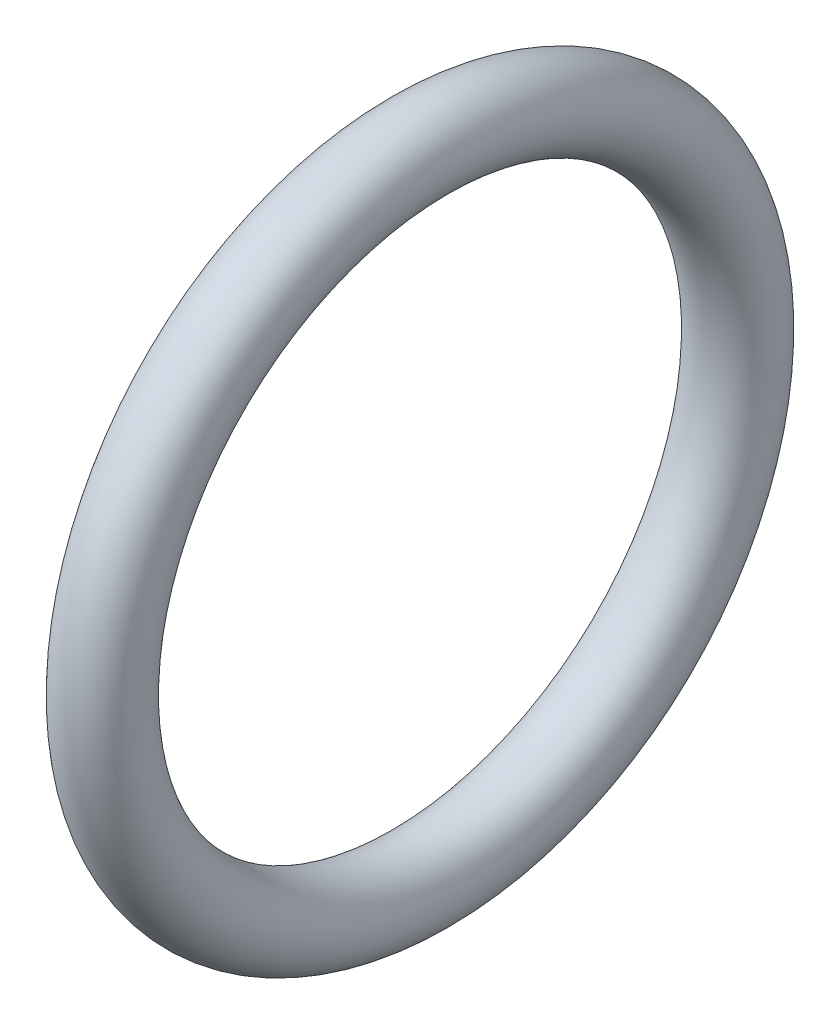
ISO-10303-21;
HEADER;
FILE_DESCRIPTION(('STEP AP214'),'2;1');
FILE_NAME('part.step','',(''),(''),'','','');
FILE_SCHEMA(('AUTOMOTIVE_DESIGN { 1 0 10303 214 1 1 1 1 }'));
ENDSEC;
DATA;
#1=APPLICATION_CONTEXT('core data for automotive mechanical design processes');
#2=APPLICATION_PROTOCOL_DEFINITION('international standard','automotive_design',2000,#1);
#3=PRODUCT_CONTEXT('',#1,'mechanical');
#4=PRODUCT('Part','Part','',(#3));
#5=PRODUCT_RELATED_PRODUCT_CATEGORY('part','',(#4));
#6=PRODUCT_DEFINITION_FORMATION('','',#4);
#7=PRODUCT_DEFINITION_CONTEXT('part definition',#1,'design');
#8=PRODUCT_DEFINITION('design','',#6,#7);
#9=PRODUCT_DEFINITION_SHAPE('','',#8);
#10=(LENGTH_UNIT() NAMED_UNIT(*) SI_UNIT(.MILLI.,.METRE.));
#11=(NAMED_UNIT(*) PLANE_ANGLE_UNIT() SI_UNIT($,.RADIAN.));
#12=(NAMED_UNIT(*) SI_UNIT($,.STERADIAN.) SOLID_ANGLE_UNIT());
#13=UNCERTAINTY_MEASURE_WITH_UNIT(LENGTH_MEASURE(1.E-05),#10,'distance_accuracy_value','');
#14=(GEOMETRIC_REPRESENTATION_CONTEXT(3) GLOBAL_UNCERTAINTY_ASSIGNED_CONTEXT((#13)) GLOBAL_UNIT_ASSIGNED_CONTEXT((#10,
#11,#12)) REPRESENTATION_CONTEXT('',''));
#15=CARTESIAN_POINT('',(0.,0.,0.));
#16=DIRECTION('',(0.,0.,1.));
#17=DIRECTION('',(1.,0.,0.));
#18=AXIS2_PLACEMENT_3D('',#15,#16,#17);
#19=CARTESIAN_POINT('',(0.,0.,0.));
#20=DIRECTION('',(1.,0.,0.));
#21=DIRECTION('',(0.,1.,0.));
#22=AXIS2_PLACEMENT_3D('',#19,#20,#21);
#23=TOROIDAL_SURFACE('',#22,4.,0.5);
#24=CARTESIAN_POINT('',(0.,4.5,0.));
#25=VERTEX_POINT('',#24);
#26=VERTEX_LOOP('',#25);
#27=FACE_BOUND('',#26,.T.);
#28=ADVANCED_FACE('F28',(#27),#23,.T.);
#29=CLOSED_SHELL('',(#28));
#30=MANIFOLD_SOLID_BREP('B2',#29);
#31=ADVANCED_BREP_SHAPE_REPRESENTATION('',(#18,#30),#14);
#32=SHAPE_DEFINITION_REPRESENTATION(#9,#31);
ENDSEC;
END-ISO-10303-21;
